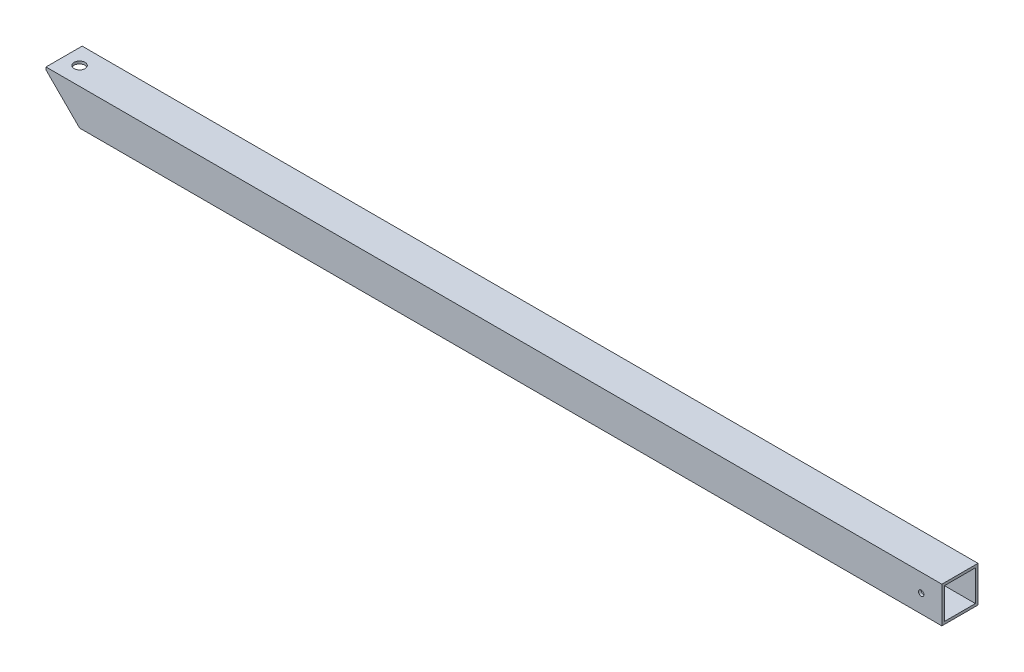
ISO-10303-21;
HEADER;
FILE_DESCRIPTION(('STEP AP214'),'2;1');
FILE_NAME('part.step','',(''),(''),'','','');
FILE_SCHEMA(('AUTOMOTIVE_DESIGN { 1 0 10303 214 1 1 1 1 }'));
ENDSEC;
DATA;
#1=APPLICATION_CONTEXT('core data for automotive mechanical design processes');
#2=APPLICATION_PROTOCOL_DEFINITION('international standard','automotive_design',2000,#1);
#3=PRODUCT_CONTEXT('',#1,'mechanical');
#4=PRODUCT('Part','Part','',(#3));
#5=PRODUCT_RELATED_PRODUCT_CATEGORY('part','',(#4));
#6=PRODUCT_DEFINITION_FORMATION('','',#4);
#7=PRODUCT_DEFINITION_CONTEXT('part definition',#1,'design');
#8=PRODUCT_DEFINITION('design','',#6,#7);
#9=PRODUCT_DEFINITION_SHAPE('','',#8);
#10=(LENGTH_UNIT() NAMED_UNIT(*) SI_UNIT(.MILLI.,.METRE.));
#11=(NAMED_UNIT(*) PLANE_ANGLE_UNIT() SI_UNIT($,.RADIAN.));
#12=(NAMED_UNIT(*) SI_UNIT($,.STERADIAN.) SOLID_ANGLE_UNIT());
#13=UNCERTAINTY_MEASURE_WITH_UNIT(LENGTH_MEASURE(1.E-05),#10,'distance_accuracy_value','');
#14=(GEOMETRIC_REPRESENTATION_CONTEXT(3) GLOBAL_UNCERTAINTY_ASSIGNED_CONTEXT((#13)) GLOBAL_UNIT_ASSIGNED_CONTEXT((#10,
#11,#12)) REPRESENTATION_CONTEXT('',''));
#15=CARTESIAN_POINT('',(0.,0.,0.));
#16=DIRECTION('',(0.,0.,1.));
#17=DIRECTION('',(1.,0.,0.));
#18=AXIS2_PLACEMENT_3D('',#15,#16,#17);
#19=CARTESIAN_POINT('',(0.,-3.175,22.225));
#20=DIRECTION('',(0.707106781186549,0.707106781186546,0.));
#21=DIRECTION('',(-0.707106781186546,0.707106781186549,0.));
#22=AXIS2_PLACEMENT_3D('',#19,#20,#21);
#23=PLANE('',#22);
#24=DIRECTION('',(0.707106781186546,-0.707106781186549,0.));
#25=VECTOR('',#24,1.);
#26=CARTESIAN_POINT('',(0.,-3.175,-19.05));
#27=LINE('',#26,#25);
#28=CARTESIAN_POINT('',(0.,-3.175,-19.05));
#29=VERTEX_POINT('',#28);
#30=CARTESIAN_POINT('',(38.0999999999999,-41.275,-19.05));
#31=VERTEX_POINT('',#30);
#32=EDGE_CURVE('E114',#29,#31,#27,.T.);
#33=ORIENTED_EDGE('',*,*,#32,.F.);
#34=DIRECTION('',(0.,0.,-1.));
#35=VECTOR('',#34,1.);
#36=CARTESIAN_POINT('',(0.,-3.175,22.225));
#37=LINE('',#36,#35);
#38=CARTESIAN_POINT('',(0.,-3.175,-22.225));
#39=VERTEX_POINT('',#38);
#40=EDGE_CURVE('E46',#29,#39,#37,.T.);
#41=ORIENTED_EDGE('',*,*,#40,.T.);
#42=DIRECTION('',(0.707106781186546,-0.707106781186549,0.));
#43=VECTOR('',#42,1.);
#44=CARTESIAN_POINT('',(0.,-3.175,-22.225));
#45=LINE('',#44,#43);
#46=CARTESIAN_POINT('',(41.2749999999998,-44.45,-22.225));
#47=VERTEX_POINT('',#46);
#48=EDGE_CURVE('E161',#39,#47,#45,.T.);
#49=ORIENTED_EDGE('',*,*,#48,.T.);
#50=DIRECTION('',(0.,0.,-1.));
#51=VECTOR('',#50,1.);
#52=CARTESIAN_POINT('',(41.2749999999998,-44.45,22.225));
#53=LINE('',#52,#51);
#54=CARTESIAN_POINT('',(41.2749999999998,-44.45,22.225));
#55=VERTEX_POINT('',#54);
#56=EDGE_CURVE('E141',#55,#47,#53,.T.);
#57=ORIENTED_EDGE('',*,*,#56,.F.);
#58=DIRECTION('',(0.707106781186546,-0.707106781186549,0.));
#59=VECTOR('',#58,1.);
#60=CARTESIAN_POINT('',(0.,-3.175,22.225));
#61=LINE('',#60,#59);
#62=CARTESIAN_POINT('',(0.,-3.175,22.225));
#63=VERTEX_POINT('',#62);
#64=EDGE_CURVE('E170',#63,#55,#61,.T.);
#65=ORIENTED_EDGE('',*,*,#64,.F.);
#66=CARTESIAN_POINT('',(0.,-3.175,19.05));
#67=VERTEX_POINT('',#66);
#68=EDGE_CURVE('E11',#63,#67,#37,.T.);
#69=ORIENTED_EDGE('',*,*,#68,.T.);
#70=DIRECTION('',(0.707106781186546,-0.707106781186549,0.));
#71=VECTOR('',#70,1.);
#72=CARTESIAN_POINT('',(0.,-3.175,19.05));
#73=LINE('',#72,#71);
#74=CARTESIAN_POINT('',(38.0999999999999,-41.275,19.05));
#75=VERTEX_POINT('',#74);
#76=EDGE_CURVE('E119',#67,#75,#73,.T.);
#77=ORIENTED_EDGE('',*,*,#76,.T.);
#78=DIRECTION('',(0.,0.,-1.));
#79=VECTOR('',#78,1.);
#80=CARTESIAN_POINT('',(38.0999999999999,-41.275,22.225));
#81=LINE('',#80,#79);
#82=EDGE_CURVE('E128',#75,#31,#81,.T.);
#83=ORIENTED_EDGE('',*,*,#82,.T.);
#84=EDGE_LOOP('',(#33,#41,#49,#57,#65,#69,#77,#83));
#85=FACE_BOUND('',#84,.T.);
#86=ADVANCED_FACE('F37',(#85),#23,.F.);
#87=CARTESIAN_POINT('',(1101.725,-44.45,22.225));
#88=DIRECTION('',(-1.,0.,0.));
#89=DIRECTION('',(0.,-1.,0.));
#90=AXIS2_PLACEMENT_3D('',#87,#88,#89);
#91=PLANE('',#90);
#92=DIRECTION('',(0.,1.,0.));
#93=VECTOR('',#92,1.);
#94=CARTESIAN_POINT('',(1101.725,-44.45,-22.225));
#95=LINE('',#94,#93);
#96=CARTESIAN_POINT('',(1101.725,-44.45,-22.225));
#97=VERTEX_POINT('',#96);
#98=CARTESIAN_POINT('',(1101.725,0.,-22.225));
#99=VERTEX_POINT('',#98);
#100=EDGE_CURVE('E157',#97,#99,#95,.T.);
#101=ORIENTED_EDGE('',*,*,#100,.T.);
#102=DIRECTION('',(0.,0.,-1.));
#103=VECTOR('',#102,1.);
#104=CARTESIAN_POINT('',(1101.725,0.,22.225));
#105=LINE('',#104,#103);
#106=CARTESIAN_POINT('',(1101.725,0.,22.225));
#107=VERTEX_POINT('',#106);
#108=EDGE_CURVE('E148',#107,#99,#105,.T.);
#109=ORIENTED_EDGE('',*,*,#108,.F.);
#110=DIRECTION('',(0.,1.,0.));
#111=VECTOR('',#110,1.);
#112=CARTESIAN_POINT('',(1101.725,-44.45,22.225));
#113=LINE('',#112,#111);
#114=CARTESIAN_POINT('',(1101.725,-44.45,22.225));
#115=VERTEX_POINT('',#114);
#116=EDGE_CURVE('E166',#115,#107,#113,.T.);
#117=ORIENTED_EDGE('',*,*,#116,.F.);
#118=DIRECTION('',(0.,0.,-1.));
#119=VECTOR('',#118,1.);
#120=CARTESIAN_POINT('',(1101.725,-44.45,22.225));
#121=LINE('',#120,#119);
#122=EDGE_CURVE('E143',#115,#97,#121,.T.);
#123=ORIENTED_EDGE('',*,*,#122,.T.);
#124=EDGE_LOOP('',(#101,#109,#117,#123));
#125=FACE_BOUND('',#124,.T.);
#126=DIRECTION('',(0.,1.,0.));
#127=VECTOR('',#126,1.);
#128=CARTESIAN_POINT('',(1101.725,-44.45,-19.05));
#129=LINE('',#128,#127);
#130=CARTESIAN_POINT('',(1101.725,-41.275,-19.05));
#131=VERTEX_POINT('',#130);
#132=CARTESIAN_POINT('',(1101.725,-3.175,-19.05));
#133=VERTEX_POINT('',#132);
#134=EDGE_CURVE('E117',#131,#133,#129,.T.);
#135=ORIENTED_EDGE('',*,*,#134,.F.);
#136=DIRECTION('',(0.,0.,-1.));
#137=VECTOR('',#136,1.);
#138=CARTESIAN_POINT('',(1101.725,-41.275,22.225));
#139=LINE('',#138,#137);
#140=CARTESIAN_POINT('',(1101.725,-41.275,19.05));
#141=VERTEX_POINT('',#140);
#142=EDGE_CURVE('E185',#141,#131,#139,.T.);
#143=ORIENTED_EDGE('',*,*,#142,.F.);
#144=DIRECTION('',(0.,1.,0.));
#145=VECTOR('',#144,1.);
#146=CARTESIAN_POINT('',(1101.725,-44.45,19.05));
#147=LINE('',#146,#145);
#148=CARTESIAN_POINT('',(1101.725,-3.175,19.05));
#149=VERTEX_POINT('',#148);
#150=EDGE_CURVE('E53',#141,#149,#147,.T.);
#151=ORIENTED_EDGE('',*,*,#150,.T.);
#152=DIRECTION('',(0.,0.,-1.));
#153=VECTOR('',#152,1.);
#154=CARTESIAN_POINT('',(1101.725,-3.175,22.225));
#155=LINE('',#154,#153);
#156=EDGE_CURVE('E183',#149,#133,#155,.T.);
#157=ORIENTED_EDGE('',*,*,#156,.T.);
#158=EDGE_LOOP('',(#135,#143,#151,#157));
#159=FACE_BOUND('',#158,.T.);
#160=ADVANCED_FACE('F218',(#125,#159),#91,.F.);
#161=CARTESIAN_POINT('',(1076.325,-22.225,22.225));
#162=DIRECTION('',(0.,0.,-1.));
#163=DIRECTION('',(-1.,0.,0.));
#164=AXIS2_PLACEMENT_3D('',#161,#162,#163);
#165=CYLINDRICAL_SURFACE('',#164,3.31470000000001);
#166=CARTESIAN_POINT('',(1076.325,-22.225,-22.225));
#167=DIRECTION('',(0.,0.,1.));
#168=DIRECTION('',(1.,0.,0.));
#169=AXIS2_PLACEMENT_3D('',#166,#167,#168);
#170=CIRCLE('',#169,3.31470000000001);
#171=CARTESIAN_POINT('',(1079.6397,-22.225,-22.225));
#172=VERTEX_POINT('',#171);
#173=EDGE_CURVE('E127',#172,#172,#170,.T.);
#174=ORIENTED_EDGE('',*,*,#173,.F.);
#175=EDGE_LOOP('',(#174));
#176=FACE_BOUND('',#175,.T.);
#177=CARTESIAN_POINT('',(1076.325,-22.225,-19.05));
#178=DIRECTION('',(0.,0.,1.));
#179=DIRECTION('',(1.,0.,0.));
#180=AXIS2_PLACEMENT_3D('',#177,#178,#179);
#181=CIRCLE('',#180,3.31470000000001);
#182=CARTESIAN_POINT('',(1079.6397,-22.225,-19.05));
#183=VERTEX_POINT('',#182);
#184=EDGE_CURVE('E178',#183,#183,#181,.T.);
#185=ORIENTED_EDGE('',*,*,#184,.T.);
#186=EDGE_LOOP('',(#185));
#187=FACE_BOUND('',#186,.T.);
#188=ADVANCED_FACE('F223',(#176,#187),#165,.F.);
#189=CARTESIAN_POINT('',(0.,0.,22.225));
#190=DIRECTION('',(0.,0.,1.));
#191=DIRECTION('',(1.,0.,0.));
#192=AXIS2_PLACEMENT_3D('',#189,#190,#191);
#193=PLANE('',#192);
#194=DIRECTION('',(0.,-1.,0.));
#195=VECTOR('',#194,1.);
#196=CARTESIAN_POINT('',(0.,0.,22.225));
#197=LINE('',#196,#195);
#198=CARTESIAN_POINT('',(0.,0.,22.225));
#199=VERTEX_POINT('',#198);
#200=EDGE_CURVE('E156',#199,#63,#197,.T.);
#201=ORIENTED_EDGE('',*,*,#200,.T.);
#202=ORIENTED_EDGE('',*,*,#64,.T.);
#203=DIRECTION('',(1.,0.,0.));
#204=VECTOR('',#203,1.);
#205=CARTESIAN_POINT('',(41.2749999999998,-44.45,22.225));
#206=LINE('',#205,#204);
#207=EDGE_CURVE('E168',#55,#115,#206,.T.);
#208=ORIENTED_EDGE('',*,*,#207,.T.);
#209=ORIENTED_EDGE('',*,*,#116,.T.);
#210=DIRECTION('',(-1.,0.,0.));
#211=VECTOR('',#210,1.);
#212=CARTESIAN_POINT('',(1101.725,0.,22.225));
#213=LINE('',#212,#211);
#214=EDGE_CURVE('E153',#107,#199,#213,.T.);
#215=ORIENTED_EDGE('',*,*,#214,.T.);
#216=EDGE_LOOP('',(#201,#202,#208,#209,#215));
#217=FACE_BOUND('',#216,.T.);
#218=CARTESIAN_POINT('',(1076.325,-22.225,22.225));
#219=DIRECTION('',(0.,0.,1.));
#220=DIRECTION('',(1.,0.,0.));
#221=AXIS2_PLACEMENT_3D('',#218,#219,#220);
#222=CIRCLE('',#221,3.31470000000001);
#223=CARTESIAN_POINT('',(1079.6397,-22.225,22.225));
#224=VERTEX_POINT('',#223);
#225=EDGE_CURVE('E164',#224,#224,#222,.T.);
#226=ORIENTED_EDGE('',*,*,#225,.F.);
#227=EDGE_LOOP('',(#226));
#228=FACE_BOUND('',#227,.T.);
#229=ADVANCED_FACE('F237',(#217,#228),#193,.T.);
#230=CARTESIAN_POINT('',(0.,0.,-22.225));
#231=DIRECTION('',(0.,0.,1.));
#232=DIRECTION('',(1.,0.,0.));
#233=AXIS2_PLACEMENT_3D('',#230,#231,#232);
#234=PLANE('',#233);
#235=DIRECTION('',(0.,-1.,0.));
#236=VECTOR('',#235,1.);
#237=CARTESIAN_POINT('',(0.,0.,-22.225));
#238=LINE('',#237,#236);
#239=CARTESIAN_POINT('',(0.,0.,-22.225));
#240=VERTEX_POINT('',#239);
#241=EDGE_CURVE('E140',#240,#39,#238,.T.);
#242=ORIENTED_EDGE('',*,*,#241,.F.);
#243=DIRECTION('',(-1.,0.,0.));
#244=VECTOR('',#243,1.);
#245=CARTESIAN_POINT('',(1101.725,0.,-22.225));
#246=LINE('',#245,#244);
#247=EDGE_CURVE('E154',#99,#240,#246,.T.);
#248=ORIENTED_EDGE('',*,*,#247,.F.);
#249=ORIENTED_EDGE('',*,*,#100,.F.);
#250=DIRECTION('',(1.,0.,0.));
#251=VECTOR('',#250,1.);
#252=CARTESIAN_POINT('',(41.2749999999998,-44.45,-22.225));
#253=LINE('',#252,#251);
#254=EDGE_CURVE('E159',#47,#97,#253,.T.);
#255=ORIENTED_EDGE('',*,*,#254,.F.);
#256=ORIENTED_EDGE('',*,*,#48,.F.);
#257=EDGE_LOOP('',(#242,#248,#249,#255,#256));
#258=FACE_BOUND('',#257,.T.);
#259=ORIENTED_EDGE('',*,*,#173,.T.);
#260=EDGE_LOOP('',(#259));
#261=FACE_BOUND('',#260,.T.);
#262=ADVANCED_FACE('F234',(#258,#261),#234,.F.);
#263=CARTESIAN_POINT('',(0.,0.,22.225));
#264=DIRECTION('',(1.,0.,0.));
#265=DIRECTION('',(0.,1.,0.));
#266=AXIS2_PLACEMENT_3D('',#263,#264,#265);
#267=PLANE('',#266);
#268=ORIENTED_EDGE('',*,*,#241,.T.);
#269=ORIENTED_EDGE('',*,*,#40,.F.);
#270=DIRECTION('',(0.,0.,-1.));
#271=VECTOR('',#270,1.);
#272=CARTESIAN_POINT('',(0.,-3.175,22.225));
#273=LINE('',#272,#271);
#274=EDGE_CURVE('E122',#67,#29,#273,.T.);
#275=ORIENTED_EDGE('',*,*,#274,.F.);
#276=ORIENTED_EDGE('',*,*,#68,.F.);
#277=ORIENTED_EDGE('',*,*,#200,.F.);
#278=DIRECTION('',(0.,0.,-1.));
#279=VECTOR('',#278,1.);
#280=CARTESIAN_POINT('',(0.,0.,22.225));
#281=LINE('',#280,#279);
#282=EDGE_CURVE('E151',#199,#240,#281,.T.);
#283=ORIENTED_EDGE('',*,*,#282,.T.);
#284=EDGE_LOOP('',(#268,#269,#275,#276,#277,#283));
#285=FACE_BOUND('',#284,.T.);
#286=ADVANCED_FACE('F39',(#285),#267,.F.);
#287=CARTESIAN_POINT('',(41.2749999999998,-44.45,22.225));
#288=DIRECTION('',(0.,1.,0.));
#289=DIRECTION('',(0.,0.,1.));
#290=AXIS2_PLACEMENT_3D('',#287,#288,#289);
#291=PLANE('',#290);
#292=ORIENTED_EDGE('',*,*,#254,.T.);
#293=ORIENTED_EDGE('',*,*,#122,.F.);
#294=ORIENTED_EDGE('',*,*,#207,.F.);
#295=ORIENTED_EDGE('',*,*,#56,.T.);
#296=EDGE_LOOP('',(#292,#293,#294,#295));
#297=FACE_BOUND('',#296,.T.);
#298=ADVANCED_FACE('F227',(#297),#291,.F.);
#299=CARTESIAN_POINT('',(1101.725,0.,22.225));
#300=DIRECTION('',(0.,-1.,0.));
#301=DIRECTION('',(0.,0.,-1.));
#302=AXIS2_PLACEMENT_3D('',#299,#300,#301);
#303=PLANE('',#302);
#304=CARTESIAN_POINT('',(19.05,0.,0.));
#305=DIRECTION('',(0.,1.,0.));
#306=DIRECTION('',(0.,0.,1.));
#307=AXIS2_PLACEMENT_3D('',#304,#305,#306);
#308=CIRCLE('',#307,6.74623999999996);
#309=CARTESIAN_POINT('',(19.05,0.,6.74623999999996));
#310=VERTEX_POINT('',#309);
#311=EDGE_CURVE('E196',#310,#310,#308,.T.);
#312=ORIENTED_EDGE('',*,*,#311,.F.);
#313=EDGE_LOOP('',(#312));
#314=FACE_BOUND('',#313,.T.);
#315=ORIENTED_EDGE('',*,*,#247,.T.);
#316=ORIENTED_EDGE('',*,*,#282,.F.);
#317=ORIENTED_EDGE('',*,*,#214,.F.);
#318=ORIENTED_EDGE('',*,*,#108,.T.);
#319=EDGE_LOOP('',(#315,#316,#317,#318));
#320=FACE_BOUND('',#319,.T.);
#321=ADVANCED_FACE('F228',(#314,#320),#303,.F.);
#322=CARTESIAN_POINT('',(1076.325,-22.225,19.05));
#323=DIRECTION('',(0.,0.,1.));
#324=DIRECTION('',(1.,0.,0.));
#325=AXIS2_PLACEMENT_3D('',#322,#323,#324);
#326=CIRCLE('',#325,3.31470000000001);
#327=CARTESIAN_POINT('',(1079.6397,-22.225,19.05));
#328=VERTEX_POINT('',#327);
#329=EDGE_CURVE('E135',#328,#328,#326,.T.);
#330=ORIENTED_EDGE('',*,*,#329,.F.);
#331=EDGE_LOOP('',(#330));
#332=FACE_BOUND('',#331,.T.);
#333=ORIENTED_EDGE('',*,*,#225,.T.);
#334=EDGE_LOOP('',(#333));
#335=FACE_BOUND('',#334,.T.);
#336=ADVANCED_FACE('F232',(#332,#335),#165,.F.);
#337=CARTESIAN_POINT('',(0.,0.,19.05));
#338=DIRECTION('',(0.,0.,1.));
#339=DIRECTION('',(1.,0.,0.));
#340=AXIS2_PLACEMENT_3D('',#337,#338,#339);
#341=PLANE('',#340);
#342=DIRECTION('',(-1.,0.,0.));
#343=VECTOR('',#342,1.);
#344=CARTESIAN_POINT('',(1101.725,-3.175,19.05));
#345=LINE('',#344,#343);
#346=EDGE_CURVE('E60',#149,#67,#345,.T.);
#347=ORIENTED_EDGE('',*,*,#346,.F.);
#348=ORIENTED_EDGE('',*,*,#150,.F.);
#349=DIRECTION('',(1.,0.,0.));
#350=VECTOR('',#349,1.);
#351=CARTESIAN_POINT('',(41.2749999999998,-41.275,19.05));
#352=LINE('',#351,#350);
#353=EDGE_CURVE('E190',#75,#141,#352,.T.);
#354=ORIENTED_EDGE('',*,*,#353,.F.);
#355=ORIENTED_EDGE('',*,*,#76,.F.);
#356=EDGE_LOOP('',(#347,#348,#354,#355));
#357=FACE_BOUND('',#356,.T.);
#358=ORIENTED_EDGE('',*,*,#329,.T.);
#359=EDGE_LOOP('',(#358));
#360=FACE_BOUND('',#359,.T.);
#361=ADVANCED_FACE('F242',(#357,#360),#341,.F.);
#362=CARTESIAN_POINT('',(0.,0.,-19.05));
#363=DIRECTION('',(0.,0.,1.));
#364=DIRECTION('',(1.,0.,0.));
#365=AXIS2_PLACEMENT_3D('',#362,#363,#364);
#366=PLANE('',#365);
#367=ORIENTED_EDGE('',*,*,#32,.T.);
#368=DIRECTION('',(1.,0.,0.));
#369=VECTOR('',#368,1.);
#370=CARTESIAN_POINT('',(41.2749999999998,-41.275,-19.05));
#371=LINE('',#370,#369);
#372=EDGE_CURVE('E134',#31,#131,#371,.T.);
#373=ORIENTED_EDGE('',*,*,#372,.T.);
#374=ORIENTED_EDGE('',*,*,#134,.T.);
#375=DIRECTION('',(-1.,0.,0.));
#376=VECTOR('',#375,1.);
#377=CARTESIAN_POINT('',(1101.725,-3.175,-19.05));
#378=LINE('',#377,#376);
#379=EDGE_CURVE('E110',#133,#29,#378,.T.);
#380=ORIENTED_EDGE('',*,*,#379,.T.);
#381=EDGE_LOOP('',(#367,#373,#374,#380));
#382=FACE_BOUND('',#381,.T.);
#383=ORIENTED_EDGE('',*,*,#184,.F.);
#384=EDGE_LOOP('',(#383));
#385=FACE_BOUND('',#384,.T.);
#386=ADVANCED_FACE('F111',(#382,#385),#366,.T.);
#387=CARTESIAN_POINT('',(41.2749999999998,-41.275,22.225));
#388=DIRECTION('',(0.,1.,0.));
#389=DIRECTION('',(0.,0.,1.));
#390=AXIS2_PLACEMENT_3D('',#387,#388,#389);
#391=PLANE('',#390);
#392=ORIENTED_EDGE('',*,*,#372,.F.);
#393=ORIENTED_EDGE('',*,*,#82,.F.);
#394=ORIENTED_EDGE('',*,*,#353,.T.);
#395=ORIENTED_EDGE('',*,*,#142,.T.);
#396=EDGE_LOOP('',(#392,#393,#394,#395));
#397=FACE_BOUND('',#396,.T.);
#398=ADVANCED_FACE('F206',(#397),#391,.T.);
#399=CARTESIAN_POINT('',(1101.725,-3.175,22.225));
#400=DIRECTION('',(0.,-1.,0.));
#401=DIRECTION('',(0.,0.,-1.));
#402=AXIS2_PLACEMENT_3D('',#399,#400,#401);
#403=PLANE('',#402);
#404=CARTESIAN_POINT('',(19.05,-3.175,0.));
#405=DIRECTION('',(0.,-1.,0.));
#406=DIRECTION('',(0.,0.,-1.));
#407=AXIS2_PLACEMENT_3D('',#404,#405,#406);
#408=CIRCLE('',#407,6.74623999999998);
#409=CARTESIAN_POINT('',(19.05,-3.175,-6.74623999999998));
#410=VERTEX_POINT('',#409);
#411=EDGE_CURVE('E41',#410,#410,#408,.T.);
#412=ORIENTED_EDGE('',*,*,#411,.F.);
#413=EDGE_LOOP('',(#412));
#414=FACE_BOUND('',#413,.T.);
#415=ORIENTED_EDGE('',*,*,#379,.F.);
#416=ORIENTED_EDGE('',*,*,#156,.F.);
#417=ORIENTED_EDGE('',*,*,#346,.T.);
#418=ORIENTED_EDGE('',*,*,#274,.T.);
#419=EDGE_LOOP('',(#415,#416,#417,#418));
#420=FACE_BOUND('',#419,.T.);
#421=ADVANCED_FACE('F123',(#414,#420),#403,.T.);
#422=CARTESIAN_POINT('',(19.05,0.,0.));
#423=DIRECTION('',(0.,1.,0.));
#424=DIRECTION('',(0.,0.,1.));
#425=AXIS2_PLACEMENT_3D('',#422,#423,#424);
#426=CYLINDRICAL_SURFACE('',#425,6.74623999999998);
#427=ORIENTED_EDGE('',*,*,#411,.T.);
#428=EDGE_LOOP('',(#427));
#429=FACE_BOUND('',#428,.T.);
#430=ORIENTED_EDGE('',*,*,#311,.T.);
#431=EDGE_LOOP('',(#430));
#432=FACE_BOUND('',#431,.T.);
#433=ADVANCED_FACE('F203',(#429,#432),#426,.F.);
#434=CLOSED_SHELL('',(#86,#160,#188,#229,#262,#286,#298,#321,#336,#361,#386,#398,#421,#433));
#435=MANIFOLD_SOLID_BREP('B2',#434);
#436=ADVANCED_BREP_SHAPE_REPRESENTATION('',(#18,#435),#14);
#437=SHAPE_DEFINITION_REPRESENTATION(#9,#436);
ENDSEC;
END-ISO-10303-21;
